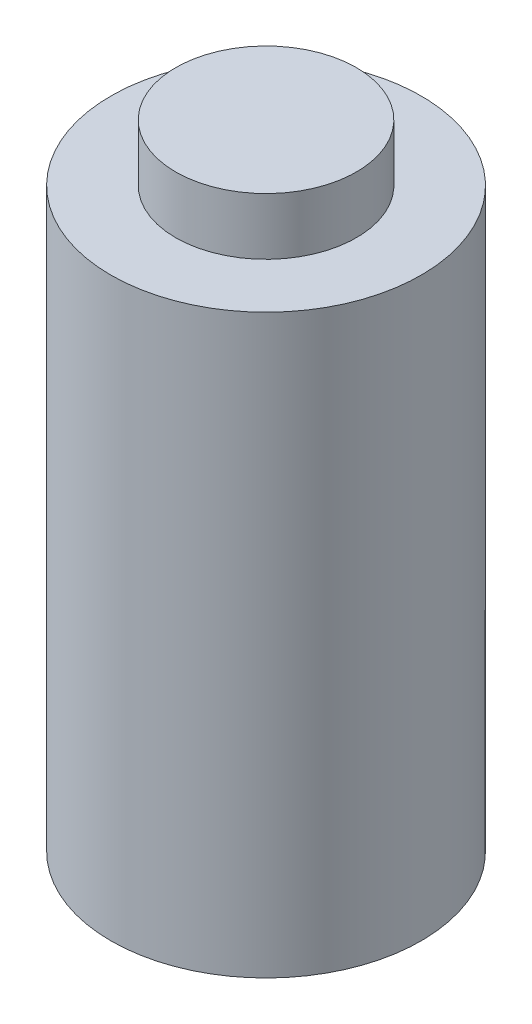
ISO-10303-21;
HEADER;
FILE_DESCRIPTION(('STEP AP214'),'2;1');
FILE_NAME('part.step','',(''),(''),'','','');
FILE_SCHEMA(('AUTOMOTIVE_DESIGN { 1 0 10303 214 1 1 1 1 }'));
ENDSEC;
DATA;
#1=APPLICATION_CONTEXT('core data for automotive mechanical design processes');
#2=APPLICATION_PROTOCOL_DEFINITION('international standard','automotive_design',2000,#1);
#3=PRODUCT_CONTEXT('',#1,'mechanical');
#4=PRODUCT('Part','Part','',(#3));
#5=PRODUCT_RELATED_PRODUCT_CATEGORY('part','',(#4));
#6=PRODUCT_DEFINITION_FORMATION('','',#4);
#7=PRODUCT_DEFINITION_CONTEXT('part definition',#1,'design');
#8=PRODUCT_DEFINITION('design','',#6,#7);
#9=PRODUCT_DEFINITION_SHAPE('','',#8);
#10=(LENGTH_UNIT() NAMED_UNIT(*) SI_UNIT(.MILLI.,.METRE.));
#11=(NAMED_UNIT(*) PLANE_ANGLE_UNIT() SI_UNIT($,.RADIAN.));
#12=(NAMED_UNIT(*) SI_UNIT($,.STERADIAN.) SOLID_ANGLE_UNIT());
#13=UNCERTAINTY_MEASURE_WITH_UNIT(LENGTH_MEASURE(1.E-05),#10,'distance_accuracy_value','');
#14=(GEOMETRIC_REPRESENTATION_CONTEXT(3) GLOBAL_UNCERTAINTY_ASSIGNED_CONTEXT((#13)) GLOBAL_UNIT_ASSIGNED_CONTEXT((#10,
#11,#12)) REPRESENTATION_CONTEXT('',''));
#15=CARTESIAN_POINT('',(0.,0.,0.));
#16=DIRECTION('',(0.,0.,1.));
#17=DIRECTION('',(1.,0.,0.));
#18=AXIS2_PLACEMENT_3D('',#15,#16,#17);
#19=CARTESIAN_POINT('',(0.,0.,0.));
#20=DIRECTION('',(0.,1.,0.));
#21=DIRECTION('',(0.,0.,1.));
#22=AXIS2_PLACEMENT_3D('',#19,#20,#21);
#23=PLANE('',#22);
#24=CARTESIAN_POINT('',(0.,0.,0.));
#25=DIRECTION('',(0.,1.,0.));
#26=DIRECTION('',(0.,0.,1.));
#27=AXIS2_PLACEMENT_3D('',#24,#25,#26);
#28=CIRCLE('',#27,21.8);
#29=CARTESIAN_POINT('',(0.,0.,21.8));
#30=VERTEX_POINT('',#29);
#31=EDGE_CURVE('E47',#30,#30,#28,.T.);
#32=ORIENTED_EDGE('',*,*,#31,.F.);
#33=EDGE_LOOP('',(#32));
#34=FACE_BOUND('',#33,.T.);
#35=CARTESIAN_POINT('',(0.,0.,0.));
#36=DIRECTION('',(0.,1.,0.));
#37=DIRECTION('',(0.,0.,1.));
#38=AXIS2_PLACEMENT_3D('',#35,#36,#37);
#39=CIRCLE('',#38,16.8);
#40=CARTESIAN_POINT('',(0.,0.,16.8));
#41=VERTEX_POINT('',#40);
#42=EDGE_CURVE('E55',#41,#41,#39,.T.);
#43=ORIENTED_EDGE('',*,*,#42,.T.);
#44=EDGE_LOOP('',(#43));
#45=FACE_BOUND('',#44,.T.);
#46=ADVANCED_FACE('F43',(#34,#45),#23,.F.);
#47=CARTESIAN_POINT('',(0.,80.,0.));
#48=DIRECTION('',(0.,-1.,0.));
#49=DIRECTION('',(0.,0.,-1.));
#50=AXIS2_PLACEMENT_3D('',#47,#48,#49);
#51=CYLINDRICAL_SURFACE('',#50,21.8);
#52=ORIENTED_EDGE('',*,*,#31,.T.);
#53=EDGE_LOOP('',(#52));
#54=FACE_BOUND('',#53,.T.);
#55=CARTESIAN_POINT('',(0.,81.,0.));
#56=DIRECTION('',(0.,1.,0.));
#57=DIRECTION('',(0.,0.,1.));
#58=AXIS2_PLACEMENT_3D('',#55,#56,#57);
#59=CIRCLE('',#58,21.8);
#60=CARTESIAN_POINT('',(0.,81.,21.8));
#61=VERTEX_POINT('',#60);
#62=EDGE_CURVE('E59',#61,#61,#59,.T.);
#63=ORIENTED_EDGE('',*,*,#62,.F.);
#64=EDGE_LOOP('',(#63));
#65=FACE_BOUND('',#64,.T.);
#66=ADVANCED_FACE('F45',(#54,#65),#51,.T.);
#67=CARTESIAN_POINT('',(0.,80.,0.));
#68=DIRECTION('',(0.,-1.,0.));
#69=DIRECTION('',(0.,0.,-1.));
#70=AXIS2_PLACEMENT_3D('',#67,#68,#69);
#71=CYLINDRICAL_SURFACE('',#70,16.8);
#72=CARTESIAN_POINT('',(0.,80.,0.));
#73=DIRECTION('',(0.,1.,0.));
#74=DIRECTION('',(0.,0.,1.));
#75=AXIS2_PLACEMENT_3D('',#72,#73,#74);
#76=CIRCLE('',#75,16.8);
#77=CARTESIAN_POINT('',(0.,80.,16.8));
#78=VERTEX_POINT('',#77);
#79=EDGE_CURVE('E62',#78,#78,#76,.T.);
#80=ORIENTED_EDGE('',*,*,#79,.T.);
#81=EDGE_LOOP('',(#80));
#82=FACE_BOUND('',#81,.T.);
#83=ORIENTED_EDGE('',*,*,#42,.F.);
#84=EDGE_LOOP('',(#83));
#85=FACE_BOUND('',#84,.T.);
#86=ADVANCED_FACE('F68',(#82,#85),#71,.F.);
#87=CARTESIAN_POINT('',(0.,80.,0.));
#88=DIRECTION('',(0.,1.,0.));
#89=DIRECTION('',(0.,0.,1.));
#90=AXIS2_PLACEMENT_3D('',#87,#88,#89);
#91=PLANE('',#90);
#92=ORIENTED_EDGE('',*,*,#79,.F.);
#93=EDGE_LOOP('',(#92));
#94=FACE_BOUND('',#93,.T.);
#95=ADVANCED_FACE('F70',(#94),#91,.F.);
#96=CARTESIAN_POINT('',(0.,81.,0.));
#97=DIRECTION('',(0.,1.,0.));
#98=DIRECTION('',(0.,0.,1.));
#99=AXIS2_PLACEMENT_3D('',#96,#97,#98);
#100=PLANE('',#99);
#101=CARTESIAN_POINT('',(0.,81.,0.));
#102=DIRECTION('',(0.,1.,0.));
#103=DIRECTION('',(0.,0.,1.));
#104=AXIS2_PLACEMENT_3D('',#101,#102,#103);
#105=CIRCLE('',#104,12.7);
#106=CARTESIAN_POINT('',(0.,81.,12.7));
#107=VERTEX_POINT('',#106);
#108=EDGE_CURVE('E10',#107,#107,#105,.T.);
#109=ORIENTED_EDGE('',*,*,#108,.F.);
#110=EDGE_LOOP('',(#109));
#111=FACE_BOUND('',#110,.T.);
#112=ORIENTED_EDGE('',*,*,#62,.T.);
#113=EDGE_LOOP('',(#112));
#114=FACE_BOUND('',#113,.T.);
#115=ADVANCED_FACE('F78',(#111,#114),#100,.T.);
#116=CARTESIAN_POINT('',(0.,89.,0.));
#117=DIRECTION('',(0.,-1.,0.));
#118=DIRECTION('',(0.,0.,-1.));
#119=AXIS2_PLACEMENT_3D('',#116,#117,#118);
#120=CYLINDRICAL_SURFACE('',#119,12.7);
#121=CARTESIAN_POINT('',(0.,89.,0.));
#122=DIRECTION('',(0.,1.,0.));
#123=DIRECTION('',(0.,0.,1.));
#124=AXIS2_PLACEMENT_3D('',#121,#122,#123);
#125=CIRCLE('',#124,12.7);
#126=CARTESIAN_POINT('',(0.,89.,12.7));
#127=VERTEX_POINT('',#126);
#128=EDGE_CURVE('E58',#127,#127,#125,.T.);
#129=ORIENTED_EDGE('',*,*,#128,.F.);
#130=EDGE_LOOP('',(#129));
#131=FACE_BOUND('',#130,.T.);
#132=ORIENTED_EDGE('',*,*,#108,.T.);
#133=EDGE_LOOP('',(#132));
#134=FACE_BOUND('',#133,.T.);
#135=ADVANCED_FACE('F90',(#131,#134),#120,.T.);
#136=CARTESIAN_POINT('',(0.,89.,0.));
#137=DIRECTION('',(0.,1.,0.));
#138=DIRECTION('',(0.,0.,1.));
#139=AXIS2_PLACEMENT_3D('',#136,#137,#138);
#140=PLANE('',#139);
#141=ORIENTED_EDGE('',*,*,#128,.T.);
#142=EDGE_LOOP('',(#141));
#143=FACE_BOUND('',#142,.T.);
#144=ADVANCED_FACE('F96',(#143),#140,.T.);
#145=CLOSED_SHELL('',(#46,#66,#86,#95,#115,#135,#144));
#146=MANIFOLD_SOLID_BREP('B2',#145);
#147=ADVANCED_BREP_SHAPE_REPRESENTATION('',(#18,#146),#14);
#148=SHAPE_DEFINITION_REPRESENTATION(#9,#147);
ENDSEC;
END-ISO-10303-21;
